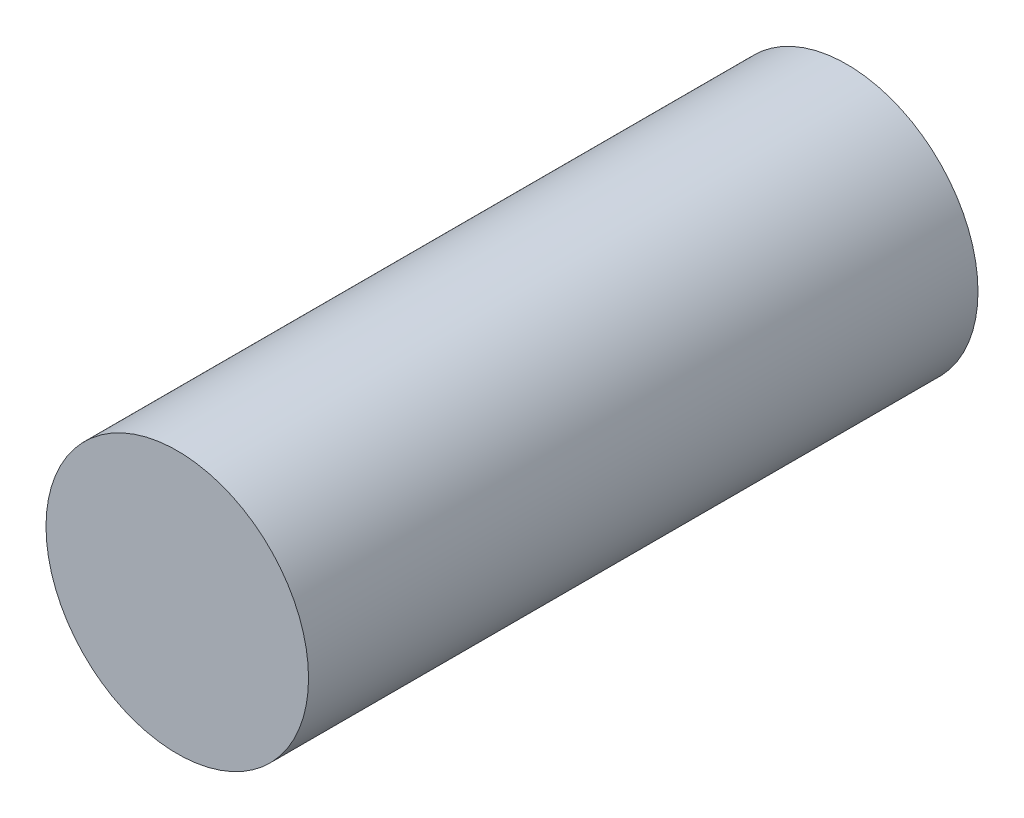
ISO-10303-21;
HEADER;
FILE_DESCRIPTION(('STEP AP214'),'2;1');
FILE_NAME('part.step','',(''),(''),'','','');
FILE_SCHEMA(('AUTOMOTIVE_DESIGN { 1 0 10303 214 1 1 1 1 }'));
ENDSEC;
DATA;
#1=APPLICATION_CONTEXT('core data for automotive mechanical design processes');
#2=APPLICATION_PROTOCOL_DEFINITION('international standard','automotive_design',2000,#1);
#3=PRODUCT_CONTEXT('',#1,'mechanical');
#4=PRODUCT('Part','Part','',(#3));
#5=PRODUCT_RELATED_PRODUCT_CATEGORY('part','',(#4));
#6=PRODUCT_DEFINITION_FORMATION('','',#4);
#7=PRODUCT_DEFINITION_CONTEXT('part definition',#1,'design');
#8=PRODUCT_DEFINITION('design','',#6,#7);
#9=PRODUCT_DEFINITION_SHAPE('','',#8);
#10=(LENGTH_UNIT() NAMED_UNIT(*) SI_UNIT(.MILLI.,.METRE.));
#11=(NAMED_UNIT(*) PLANE_ANGLE_UNIT() SI_UNIT($,.RADIAN.));
#12=(NAMED_UNIT(*) SI_UNIT($,.STERADIAN.) SOLID_ANGLE_UNIT());
#13=UNCERTAINTY_MEASURE_WITH_UNIT(LENGTH_MEASURE(1.E-05),#10,'distance_accuracy_value','');
#14=(GEOMETRIC_REPRESENTATION_CONTEXT(3) GLOBAL_UNCERTAINTY_ASSIGNED_CONTEXT((#13)) GLOBAL_UNIT_ASSIGNED_CONTEXT((#10,
#11,#12)) REPRESENTATION_CONTEXT('',''));
#15=CARTESIAN_POINT('',(0.,0.,0.));
#16=DIRECTION('',(0.,0.,1.));
#17=DIRECTION('',(1.,0.,0.));
#18=AXIS2_PLACEMENT_3D('',#15,#16,#17);
#19=CARTESIAN_POINT('',(0.,0.,66.3));
#20=DIRECTION('',(0.,0.,-1.));
#21=DIRECTION('',(-1.,0.,0.));
#22=AXIS2_PLACEMENT_3D('',#19,#20,#21);
#23=CYLINDRICAL_SURFACE('',#22,13.);
#24=CARTESIAN_POINT('',(0.,0.,66.3));
#25=DIRECTION('',(0.,0.,1.));
#26=DIRECTION('',(1.,0.,0.));
#27=AXIS2_PLACEMENT_3D('',#24,#25,#26);
#28=CIRCLE('',#27,13.);
#29=CARTESIAN_POINT('',(13.,0.,66.3));
#30=VERTEX_POINT('',#29);
#31=EDGE_CURVE('E10',#30,#30,#28,.T.);
#32=ORIENTED_EDGE('',*,*,#31,.F.);
#33=EDGE_LOOP('',(#32));
#34=FACE_BOUND('',#33,.T.);
#35=CARTESIAN_POINT('',(0.,0.,0.));
#36=DIRECTION('',(0.,0.,1.));
#37=DIRECTION('',(1.,0.,0.));
#38=AXIS2_PLACEMENT_3D('',#35,#36,#37);
#39=CIRCLE('',#38,13.);
#40=CARTESIAN_POINT('',(13.,0.,0.));
#41=VERTEX_POINT('',#40);
#42=EDGE_CURVE('E34',#41,#41,#39,.T.);
#43=ORIENTED_EDGE('',*,*,#42,.T.);
#44=EDGE_LOOP('',(#43));
#45=FACE_BOUND('',#44,.T.);
#46=ADVANCED_FACE('F31',(#34,#45),#23,.T.);
#47=CARTESIAN_POINT('',(0.,0.,66.3));
#48=DIRECTION('',(0.,0.,1.));
#49=DIRECTION('',(1.,0.,0.));
#50=AXIS2_PLACEMENT_3D('',#47,#48,#49);
#51=PLANE('',#50);
#52=ORIENTED_EDGE('',*,*,#31,.T.);
#53=EDGE_LOOP('',(#52));
#54=FACE_BOUND('',#53,.T.);
#55=ADVANCED_FACE('F46',(#54),#51,.T.);
#56=CARTESIAN_POINT('',(0.,0.,0.));
#57=DIRECTION('',(0.,0.,1.));
#58=DIRECTION('',(1.,0.,0.));
#59=AXIS2_PLACEMENT_3D('',#56,#57,#58);
#60=PLANE('',#59);
#61=ORIENTED_EDGE('',*,*,#42,.F.);
#62=EDGE_LOOP('',(#61));
#63=FACE_BOUND('',#62,.T.);
#64=ADVANCED_FACE('F44',(#63),#60,.F.);
#65=CLOSED_SHELL('',(#46,#55,#64));
#66=MANIFOLD_SOLID_BREP('B2',#65);
#67=ADVANCED_BREP_SHAPE_REPRESENTATION('',(#18,#66),#14);
#68=SHAPE_DEFINITION_REPRESENTATION(#9,#67);
ENDSEC;
END-ISO-10303-21;
